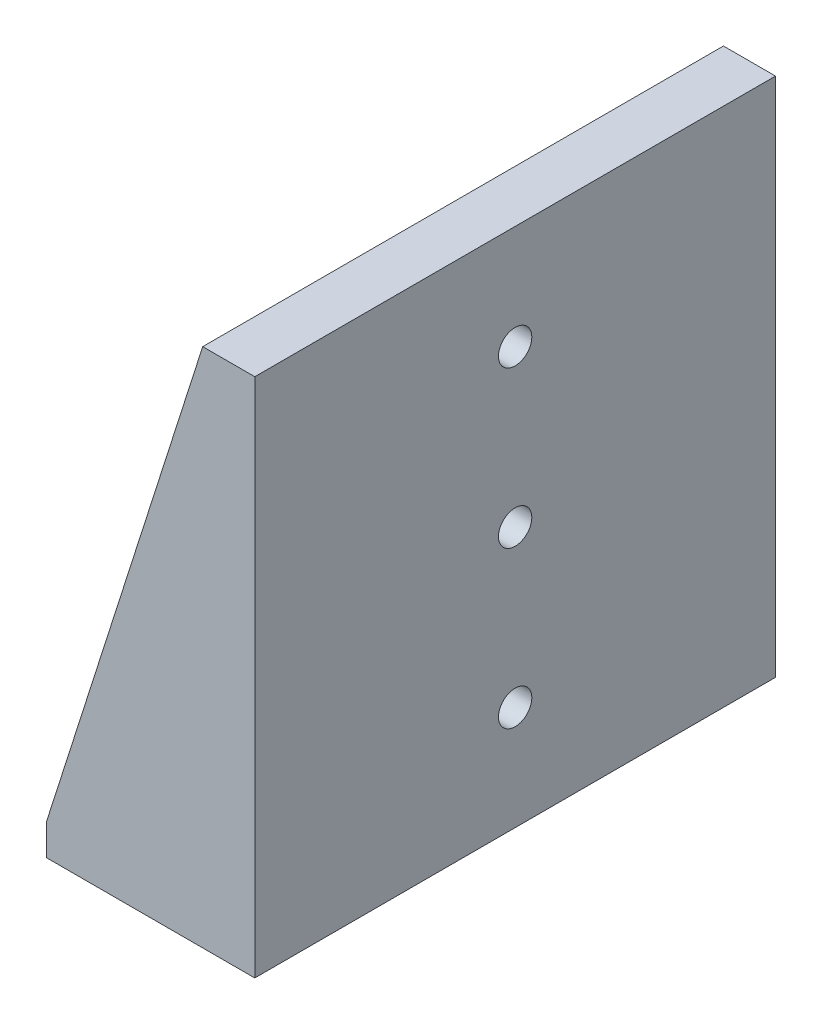
ISO-10303-21;
HEADER;
FILE_DESCRIPTION(('STEP AP214'),'2;1');
FILE_NAME('part.step','',(''),(''),'','','');
FILE_SCHEMA(('AUTOMOTIVE_DESIGN { 1 0 10303 214 1 1 1 1 }'));
ENDSEC;
DATA;
#1=APPLICATION_CONTEXT('core data for automotive mechanical design processes');
#2=APPLICATION_PROTOCOL_DEFINITION('international standard','automotive_design',2000,#1);
#3=PRODUCT_CONTEXT('',#1,'mechanical');
#4=PRODUCT('Part','Part','',(#3));
#5=PRODUCT_RELATED_PRODUCT_CATEGORY('part','',(#4));
#6=PRODUCT_DEFINITION_FORMATION('','',#4);
#7=PRODUCT_DEFINITION_CONTEXT('part definition',#1,'design');
#8=PRODUCT_DEFINITION('design','',#6,#7);
#9=PRODUCT_DEFINITION_SHAPE('','',#8);
#10=(LENGTH_UNIT() NAMED_UNIT(*) SI_UNIT(.MILLI.,.METRE.));
#11=(NAMED_UNIT(*) PLANE_ANGLE_UNIT() SI_UNIT($,.RADIAN.));
#12=(NAMED_UNIT(*) SI_UNIT($,.STERADIAN.) SOLID_ANGLE_UNIT());
#13=UNCERTAINTY_MEASURE_WITH_UNIT(LENGTH_MEASURE(1.E-05),#10,'distance_accuracy_value','');
#14=(GEOMETRIC_REPRESENTATION_CONTEXT(3) GLOBAL_UNCERTAINTY_ASSIGNED_CONTEXT((#13)) GLOBAL_UNIT_ASSIGNED_CONTEXT((#10,
#11,#12)) REPRESENTATION_CONTEXT('',''));
#15=CARTESIAN_POINT('',(0.,0.,0.));
#16=DIRECTION('',(0.,0.,1.));
#17=DIRECTION('',(1.,0.,0.));
#18=AXIS2_PLACEMENT_3D('',#15,#16,#17);
#19=CARTESIAN_POINT('',(-10.,3.,50.));
#20=DIRECTION('',(0.952659211218683,-0.304040173793197,0.));
#21=DIRECTION('',(0.304040173793197,0.952659211218683,0.));
#22=AXIS2_PLACEMENT_3D('',#19,#20,#21);
#23=PLANE('',#22);
#24=DIRECTION('',(0.,0.,-1.));
#25=VECTOR('',#24,1.);
#26=CARTESIAN_POINT('',(5.,50.,50.));
#27=LINE('',#26,#25);
#28=CARTESIAN_POINT('',(5.,50.,50.));
#29=VERTEX_POINT('',#28);
#30=CARTESIAN_POINT('',(5.,50.,47.5));
#31=VERTEX_POINT('',#30);
#32=EDGE_CURVE('E293',#29,#31,#27,.T.);
#33=ORIENTED_EDGE('',*,*,#32,.T.);
#34=DIRECTION('',(-0.304040173793197,-0.952659211218683,0.));
#35=VECTOR('',#34,1.);
#36=CARTESIAN_POINT('',(-10.,3.,47.5));
#37=LINE('',#36,#35);
#38=CARTESIAN_POINT('',(-9.68128901761478,3.99862774480702,47.5));
#39=VERTEX_POINT('',#38);
#40=EDGE_CURVE('E245',#31,#39,#37,.T.);
#41=ORIENTED_EDGE('',*,*,#40,.T.);
#42=CARTESIAN_POINT('',(-9.68128901761478,3.99862774480702,46.5));
#43=DIRECTION('',(0.952659211218683,-0.304040173793197,0.));
#44=DIRECTION('',(0.304040173793197,0.952659211218683,0.));
#45=AXIS2_PLACEMENT_3D('',#42,#43,#44);
#46=ELLIPSE('',#45,1.04969330923779,1.);
#47=CARTESIAN_POINT('',(-10.,3.,46.5523700993091));
#48=VERTEX_POINT('',#47);
#49=EDGE_CURVE('E322',#39,#48,#46,.T.);
#50=ORIENTED_EDGE('',*,*,#49,.T.);
#51=DIRECTION('',(0.,0.,-1.));
#52=VECTOR('',#51,1.);
#53=CARTESIAN_POINT('',(-10.,3.,50.));
#54=LINE('',#53,#52);
#55=CARTESIAN_POINT('',(-10.,3.,50.));
#56=VERTEX_POINT('',#55);
#57=EDGE_CURVE('E64',#56,#48,#54,.T.);
#58=ORIENTED_EDGE('',*,*,#57,.F.);
#59=DIRECTION('',(-0.304040173793197,-0.952659211218683,0.));
#60=VECTOR('',#59,1.);
#61=CARTESIAN_POINT('',(-10.,3.,50.));
#62=LINE('',#61,#60);
#63=EDGE_CURVE('E258',#29,#56,#62,.T.);
#64=ORIENTED_EDGE('',*,*,#63,.F.);
#65=EDGE_LOOP('',(#33,#41,#50,#58,#64));
#66=FACE_BOUND('',#65,.T.);
#67=ADVANCED_FACE('F39',(#66),#23,.F.);
#68=CARTESIAN_POINT('',(10.,0.,50.));
#69=DIRECTION('',(-1.,0.,0.));
#70=DIRECTION('',(0.,0.,1.));
#71=AXIS2_PLACEMENT_3D('',#68,#69,#70);
#72=PLANE('',#71);
#73=CARTESIAN_POINT('',(10.,10.,25.));
#74=DIRECTION('',(1.,0.,0.));
#75=DIRECTION('',(0.,0.,-1.));
#76=AXIS2_PLACEMENT_3D('',#73,#74,#75);
#77=CIRCLE('',#76,1.6);
#78=CARTESIAN_POINT('',(10.,10.,23.4));
#79=VERTEX_POINT('',#78);
#80=EDGE_CURVE('E203',#79,#79,#77,.T.);
#81=ORIENTED_EDGE('',*,*,#80,.F.);
#82=EDGE_LOOP('',(#81));
#83=FACE_BOUND('',#82,.T.);
#84=CARTESIAN_POINT('',(10.,25.,25.));
#85=DIRECTION('',(1.,0.,0.));
#86=DIRECTION('',(0.,0.,-1.));
#87=AXIS2_PLACEMENT_3D('',#84,#85,#86);
#88=CIRCLE('',#87,1.6);
#89=CARTESIAN_POINT('',(10.,25.,23.4));
#90=VERTEX_POINT('',#89);
#91=EDGE_CURVE('E212',#90,#90,#88,.T.);
#92=ORIENTED_EDGE('',*,*,#91,.F.);
#93=EDGE_LOOP('',(#92));
#94=FACE_BOUND('',#93,.T.);
#95=CARTESIAN_POINT('',(10.,40.,25.));
#96=DIRECTION('',(1.,0.,0.));
#97=DIRECTION('',(0.,0.,-1.));
#98=AXIS2_PLACEMENT_3D('',#95,#96,#97);
#99=CIRCLE('',#98,1.6);
#100=CARTESIAN_POINT('',(10.,40.,23.4));
#101=VERTEX_POINT('',#100);
#102=EDGE_CURVE('E220',#101,#101,#99,.T.);
#103=ORIENTED_EDGE('',*,*,#102,.F.);
#104=EDGE_LOOP('',(#103));
#105=FACE_BOUND('',#104,.T.);
#106=DIRECTION('',(0.,1.,0.));
#107=VECTOR('',#106,1.);
#108=CARTESIAN_POINT('',(10.,0.,0.));
#109=LINE('',#108,#107);
#110=CARTESIAN_POINT('',(10.,0.,0.));
#111=VERTEX_POINT('',#110);
#112=CARTESIAN_POINT('',(10.,50.,0.));
#113=VERTEX_POINT('',#112);
#114=EDGE_CURVE('E249',#111,#113,#109,.T.);
#115=ORIENTED_EDGE('',*,*,#114,.T.);
#116=DIRECTION('',(0.,0.,-1.));
#117=VECTOR('',#116,1.);
#118=CARTESIAN_POINT('',(10.,50.,50.));
#119=LINE('',#118,#117);
#120=CARTESIAN_POINT('',(10.,50.,50.));
#121=VERTEX_POINT('',#120);
#122=EDGE_CURVE('E297',#121,#113,#119,.T.);
#123=ORIENTED_EDGE('',*,*,#122,.F.);
#124=DIRECTION('',(0.,1.,0.));
#125=VECTOR('',#124,1.);
#126=CARTESIAN_POINT('',(10.,0.,50.));
#127=LINE('',#126,#125);
#128=CARTESIAN_POINT('',(10.,0.,50.));
#129=VERTEX_POINT('',#128);
#130=EDGE_CURVE('E250',#129,#121,#127,.T.);
#131=ORIENTED_EDGE('',*,*,#130,.F.);
#132=DIRECTION('',(0.,0.,-1.));
#133=VECTOR('',#132,1.);
#134=CARTESIAN_POINT('',(10.,0.,50.));
#135=LINE('',#134,#133);
#136=EDGE_CURVE('E267',#129,#111,#135,.T.);
#137=ORIENTED_EDGE('',*,*,#136,.T.);
#138=EDGE_LOOP('',(#115,#123,#131,#137));
#139=FACE_BOUND('',#138,.T.);
#140=ADVANCED_FACE('F405',(#83,#94,#105,#139),#72,.F.);
#141=CARTESIAN_POINT('',(5.,50.,50.));
#142=DIRECTION('',(0.,-1.,0.));
#143=DIRECTION('',(0.,0.,-1.));
#144=AXIS2_PLACEMENT_3D('',#141,#142,#143);
#145=PLANE('',#144);
#146=DIRECTION('',(-1.,0.,0.));
#147=VECTOR('',#146,1.);
#148=CARTESIAN_POINT('',(5.,50.,0.));
#149=LINE('',#148,#147);
#150=CARTESIAN_POINT('',(5.,50.,0.));
#151=VERTEX_POINT('',#150);
#152=EDGE_CURVE('E271',#113,#151,#149,.T.);
#153=ORIENTED_EDGE('',*,*,#152,.T.);
#154=CARTESIAN_POINT('',(5.,50.,2.5));
#155=VERTEX_POINT('',#154);
#156=EDGE_CURVE('E292',#155,#151,#27,.T.);
#157=ORIENTED_EDGE('',*,*,#156,.F.);
#158=DIRECTION('',(0.,0.,-1.));
#159=VECTOR('',#158,1.);
#160=CARTESIAN_POINT('',(5.,50.,2.5));
#161=LINE('',#160,#159);
#162=EDGE_CURVE('E229',#31,#155,#161,.T.);
#163=ORIENTED_EDGE('',*,*,#162,.F.);
#164=ORIENTED_EDGE('',*,*,#32,.F.);
#165=DIRECTION('',(-1.,0.,0.));
#166=VECTOR('',#165,1.);
#167=CARTESIAN_POINT('',(5.,50.,50.));
#168=LINE('',#167,#166);
#169=EDGE_CURVE('E254',#121,#29,#168,.T.);
#170=ORIENTED_EDGE('',*,*,#169,.F.);
#171=ORIENTED_EDGE('',*,*,#122,.T.);
#172=EDGE_LOOP('',(#153,#157,#163,#164,#170,#171));
#173=FACE_BOUND('',#172,.T.);
#174=ADVANCED_FACE('F357',(#173),#145,.F.);
#175=CARTESIAN_POINT('',(-10.,3.,3.44762990069088));
#176=VERTEX_POINT('',#175);
#177=CARTESIAN_POINT('',(-10.,3.,0.));
#178=VERTEX_POINT('',#177);
#179=EDGE_CURVE('E56',#176,#178,#54,.T.);
#180=ORIENTED_EDGE('',*,*,#179,.F.);
#181=CARTESIAN_POINT('',(-9.68128901761478,3.99862774480702,3.5));
#182=DIRECTION('',(0.952659211218683,-0.304040173793197,0.));
#183=DIRECTION('',(0.304040173793197,0.952659211218683,0.));
#184=AXIS2_PLACEMENT_3D('',#181,#182,#183);
#185=ELLIPSE('',#184,1.04969330923779,1.);
#186=CARTESIAN_POINT('',(-9.68128901761478,3.99862774480702,2.5));
#187=VERTEX_POINT('',#186);
#188=EDGE_CURVE('E11',#176,#187,#185,.T.);
#189=ORIENTED_EDGE('',*,*,#188,.T.);
#190=DIRECTION('',(0.304040173793197,0.952659211218683,0.));
#191=VECTOR('',#190,1.);
#192=CARTESIAN_POINT('',(-10.,3.,2.5));
#193=LINE('',#192,#191);
#194=EDGE_CURVE('E240',#187,#155,#193,.T.);
#195=ORIENTED_EDGE('',*,*,#194,.T.);
#196=ORIENTED_EDGE('',*,*,#156,.T.);
#197=DIRECTION('',(-0.304040173793197,-0.952659211218683,0.));
#198=VECTOR('',#197,1.);
#199=CARTESIAN_POINT('',(-10.,3.,0.));
#200=LINE('',#199,#198);
#201=EDGE_CURVE('E275',#151,#178,#200,.T.);
#202=ORIENTED_EDGE('',*,*,#201,.T.);
#203=EDGE_LOOP('',(#180,#189,#195,#196,#202));
#204=FACE_BOUND('',#203,.T.);
#205=ADVANCED_FACE('F350',(#204),#23,.F.);
#206=CARTESIAN_POINT('',(-10.,0.,50.));
#207=DIRECTION('',(1.,0.,0.));
#208=DIRECTION('',(0.,0.,-1.));
#209=AXIS2_PLACEMENT_3D('',#206,#207,#208);
#210=PLANE('',#209);
#211=ORIENTED_EDGE('',*,*,#57,.T.);
#212=CARTESIAN_POINT('',(-10.,3.99862774480702,46.5));
#213=DIRECTION('',(1.,0.,0.));
#214=DIRECTION('',(0.,0.,-1.));
#215=AXIS2_PLACEMENT_3D('',#212,#213,#214);
#216=CIRCLE('',#215,1.);
#217=CARTESIAN_POINT('',(-10.,2.99862774480702,46.5));
#218=VERTEX_POINT('',#217);
#219=EDGE_CURVE('E325',#48,#218,#216,.T.);
#220=ORIENTED_EDGE('',*,*,#219,.T.);
#221=DIRECTION('',(0.,0.,1.));
#222=VECTOR('',#221,1.);
#223=CARTESIAN_POINT('',(-10.,2.99862774480702,2.5));
#224=LINE('',#223,#222);
#225=CARTESIAN_POINT('',(-10.,2.99862774480702,3.5));
#226=VERTEX_POINT('',#225);
#227=EDGE_CURVE('E228',#226,#218,#224,.T.);
#228=ORIENTED_EDGE('',*,*,#227,.F.);
#229=CARTESIAN_POINT('',(-10.,3.99862774480702,3.5));
#230=DIRECTION('',(1.,0.,0.));
#231=DIRECTION('',(0.,0.,-1.));
#232=AXIS2_PLACEMENT_3D('',#229,#230,#231);
#233=CIRCLE('',#232,1.);
#234=EDGE_CURVE('E49',#226,#176,#233,.T.);
#235=ORIENTED_EDGE('',*,*,#234,.T.);
#236=ORIENTED_EDGE('',*,*,#179,.T.);
#237=DIRECTION('',(0.,-1.,0.));
#238=VECTOR('',#237,1.);
#239=CARTESIAN_POINT('',(-10.,0.,0.));
#240=LINE('',#239,#238);
#241=CARTESIAN_POINT('',(-10.,0.,0.));
#242=VERTEX_POINT('',#241);
#243=EDGE_CURVE('E278',#178,#242,#240,.T.);
#244=ORIENTED_EDGE('',*,*,#243,.T.);
#245=DIRECTION('',(0.,0.,-1.));
#246=VECTOR('',#245,1.);
#247=CARTESIAN_POINT('',(-10.,0.,50.));
#248=LINE('',#247,#246);
#249=CARTESIAN_POINT('',(-10.,0.,50.));
#250=VERTEX_POINT('',#249);
#251=EDGE_CURVE('E286',#250,#242,#248,.T.);
#252=ORIENTED_EDGE('',*,*,#251,.F.);
#253=DIRECTION('',(0.,-1.,0.));
#254=VECTOR('',#253,1.);
#255=CARTESIAN_POINT('',(-10.,0.,50.));
#256=LINE('',#255,#254);
#257=EDGE_CURVE('E261',#56,#250,#256,.T.);
#258=ORIENTED_EDGE('',*,*,#257,.F.);
#259=EDGE_LOOP('',(#211,#220,#228,#235,#236,#244,#252,#258));
#260=FACE_BOUND('',#259,.T.);
#261=ADVANCED_FACE('F364',(#260),#210,.F.);
#262=CARTESIAN_POINT('',(-10.,0.,50.));
#263=DIRECTION('',(0.,1.,0.));
#264=DIRECTION('',(-1.,0.,0.));
#265=AXIS2_PLACEMENT_3D('',#262,#263,#264);
#266=PLANE('',#265);
#267=DIRECTION('',(1.,0.,0.));
#268=VECTOR('',#267,1.);
#269=CARTESIAN_POINT('',(-7.,0.,24.));
#270=LINE('',#269,#268);
#271=CARTESIAN_POINT('',(-7.,0.,24.));
#272=VERTEX_POINT('',#271);
#273=CARTESIAN_POINT('',(3.,0.,24.));
#274=VERTEX_POINT('',#273);
#275=EDGE_CURVE('E343',#272,#274,#270,.T.);
#276=ORIENTED_EDGE('',*,*,#275,.F.);
#277=CARTESIAN_POINT('',(-7.,0.,25.));
#278=DIRECTION('',(0.,1.,0.));
#279=DIRECTION('',(-1.,0.,0.));
#280=AXIS2_PLACEMENT_3D('',#277,#278,#279);
#281=CIRCLE('',#280,1.);
#282=CARTESIAN_POINT('',(-7.,0.,26.));
#283=VERTEX_POINT('',#282);
#284=EDGE_CURVE('E204',#283,#272,#281,.F.);
#285=ORIENTED_EDGE('',*,*,#284,.F.);
#286=DIRECTION('',(-1.,0.,0.));
#287=VECTOR('',#286,1.);
#288=CARTESIAN_POINT('',(-7.,0.,26.));
#289=LINE('',#288,#287);
#290=CARTESIAN_POINT('',(3.,0.,26.));
#291=VERTEX_POINT('',#290);
#292=EDGE_CURVE('E200',#291,#283,#289,.T.);
#293=ORIENTED_EDGE('',*,*,#292,.F.);
#294=CARTESIAN_POINT('',(3.,0.,25.));
#295=DIRECTION('',(0.,1.,0.));
#296=DIRECTION('',(-1.,0.,0.));
#297=AXIS2_PLACEMENT_3D('',#294,#295,#296);
#298=CIRCLE('',#297,1.);
#299=EDGE_CURVE('E160',#274,#291,#298,.F.);
#300=ORIENTED_EDGE('',*,*,#299,.F.);
#301=EDGE_LOOP('',(#276,#285,#293,#300));
#302=FACE_BOUND('',#301,.T.);
#303=DIRECTION('',(1.,0.,0.));
#304=VECTOR('',#303,1.);
#305=CARTESIAN_POINT('',(-10.,0.,0.));
#306=LINE('',#305,#304);
#307=EDGE_CURVE('E255',#242,#111,#306,.T.);
#308=ORIENTED_EDGE('',*,*,#307,.T.);
#309=ORIENTED_EDGE('',*,*,#136,.F.);
#310=DIRECTION('',(1.,0.,0.));
#311=VECTOR('',#310,1.);
#312=CARTESIAN_POINT('',(-10.,0.,50.));
#313=LINE('',#312,#311);
#314=EDGE_CURVE('E264',#250,#129,#313,.T.);
#315=ORIENTED_EDGE('',*,*,#314,.F.);
#316=ORIENTED_EDGE('',*,*,#251,.T.);
#317=EDGE_LOOP('',(#308,#309,#315,#316));
#318=FACE_BOUND('',#317,.T.);
#319=ADVANCED_FACE('F367',(#302,#318),#266,.F.);
#320=CARTESIAN_POINT('',(0.,0.,50.));
#321=DIRECTION('',(0.,0.,-1.));
#322=DIRECTION('',(-1.,0.,0.));
#323=AXIS2_PLACEMENT_3D('',#320,#321,#322);
#324=PLANE('',#323);
#325=ORIENTED_EDGE('',*,*,#130,.T.);
#326=ORIENTED_EDGE('',*,*,#169,.T.);
#327=ORIENTED_EDGE('',*,*,#63,.T.);
#328=ORIENTED_EDGE('',*,*,#257,.T.);
#329=ORIENTED_EDGE('',*,*,#314,.T.);
#330=EDGE_LOOP('',(#325,#326,#327,#328,#329));
#331=FACE_BOUND('',#330,.T.);
#332=ADVANCED_FACE('F371',(#331),#324,.F.);
#333=CARTESIAN_POINT('',(0.,0.,0.));
#334=DIRECTION('',(0.,0.,-1.));
#335=DIRECTION('',(-1.,0.,0.));
#336=AXIS2_PLACEMENT_3D('',#333,#334,#335);
#337=PLANE('',#336);
#338=ORIENTED_EDGE('',*,*,#114,.F.);
#339=ORIENTED_EDGE('',*,*,#307,.F.);
#340=ORIENTED_EDGE('',*,*,#243,.F.);
#341=ORIENTED_EDGE('',*,*,#201,.F.);
#342=ORIENTED_EDGE('',*,*,#152,.F.);
#343=EDGE_LOOP('',(#338,#339,#340,#341,#342));
#344=FACE_BOUND('',#343,.T.);
#345=ADVANCED_FACE('F361',(#344),#337,.T.);
#346=CARTESIAN_POINT('',(5.,2.99862774480702,47.5));
#347=DIRECTION('',(0.,0.,1.));
#348=DIRECTION('',(1.,0.,0.));
#349=AXIS2_PLACEMENT_3D('',#346,#347,#348);
#350=PLANE('',#349);
#351=DIRECTION('',(0.,1.,0.));
#352=VECTOR('',#351,1.);
#353=CARTESIAN_POINT('',(5.,2.99862774480702,47.5));
#354=LINE('',#353,#352);
#355=CARTESIAN_POINT('',(5.,3.99862774480702,47.5));
#356=VERTEX_POINT('',#355);
#357=EDGE_CURVE('E237',#356,#31,#354,.T.);
#358=ORIENTED_EDGE('',*,*,#357,.F.);
#359=DIRECTION('',(-1.,0.,0.));
#360=VECTOR('',#359,1.);
#361=CARTESIAN_POINT('',(-10.,3.99862774480702,47.5));
#362=LINE('',#361,#360);
#363=EDGE_CURVE('E316',#356,#39,#362,.T.);
#364=ORIENTED_EDGE('',*,*,#363,.T.);
#365=ORIENTED_EDGE('',*,*,#40,.F.);
#366=EDGE_LOOP('',(#358,#364,#365));
#367=FACE_BOUND('',#366,.T.);
#368=ADVANCED_FACE('F393',(#367),#350,.F.);
#369=CARTESIAN_POINT('',(5.,50.,2.5));
#370=DIRECTION('',(0.,0.,-1.));
#371=DIRECTION('',(0.,1.,0.));
#372=AXIS2_PLACEMENT_3D('',#369,#370,#371);
#373=PLANE('',#372);
#374=ORIENTED_EDGE('',*,*,#194,.F.);
#375=DIRECTION('',(-1.,0.,0.));
#376=VECTOR('',#375,1.);
#377=CARTESIAN_POINT('',(5.,3.99862774480702,2.5));
#378=LINE('',#377,#376);
#379=CARTESIAN_POINT('',(5.,3.99862774480702,2.5));
#380=VERTEX_POINT('',#379);
#381=EDGE_CURVE('E319',#187,#380,#378,.F.);
#382=ORIENTED_EDGE('',*,*,#381,.T.);
#383=DIRECTION('',(0.,-1.,0.));
#384=VECTOR('',#383,1.);
#385=CARTESIAN_POINT('',(5.,50.,2.5));
#386=LINE('',#385,#384);
#387=EDGE_CURVE('E233',#155,#380,#386,.T.);
#388=ORIENTED_EDGE('',*,*,#387,.F.);
#389=EDGE_LOOP('',(#374,#382,#388));
#390=FACE_BOUND('',#389,.T.);
#391=ADVANCED_FACE('F388',(#390),#373,.F.);
#392=CARTESIAN_POINT('',(5.,2.99862774480702,2.5));
#393=DIRECTION('',(0.,-1.,0.));
#394=DIRECTION('',(0.,0.,-1.));
#395=AXIS2_PLACEMENT_3D('',#392,#393,#394);
#396=PLANE('',#395);
#397=ORIENTED_EDGE('',*,*,#227,.T.);
#398=DIRECTION('',(-1.,0.,0.));
#399=VECTOR('',#398,1.);
#400=CARTESIAN_POINT('',(5.,2.99862774480702,46.5));
#401=LINE('',#400,#399);
#402=CARTESIAN_POINT('',(4.,2.99862774480702,46.5));
#403=VERTEX_POINT('',#402);
#404=EDGE_CURVE('E313',#218,#403,#401,.F.);
#405=ORIENTED_EDGE('',*,*,#404,.T.);
#406=DIRECTION('',(0.,0.,1.));
#407=VECTOR('',#406,1.);
#408=CARTESIAN_POINT('',(4.,2.99862774480702,2.5));
#409=LINE('',#408,#407);
#410=CARTESIAN_POINT('',(4.,2.99862774480702,25.));
#411=VERTEX_POINT('',#410);
#412=EDGE_CURVE('E181',#403,#411,#409,.F.);
#413=ORIENTED_EDGE('',*,*,#412,.T.);
#414=CARTESIAN_POINT('',(3.,2.99862774480702,25.));
#415=DIRECTION('',(0.,1.,0.));
#416=DIRECTION('',(0.,0.,1.));
#417=AXIS2_PLACEMENT_3D('',#414,#415,#416);
#418=CIRCLE('',#417,1.);
#419=CARTESIAN_POINT('',(3.,2.99862774480702,26.));
#420=VERTEX_POINT('',#419);
#421=EDGE_CURVE('E156',#420,#411,#418,.T.);
#422=ORIENTED_EDGE('',*,*,#421,.F.);
#423=DIRECTION('',(1.,0.,0.));
#424=VECTOR('',#423,1.);
#425=CARTESIAN_POINT('',(-7.,2.99862774480702,26.));
#426=LINE('',#425,#424);
#427=CARTESIAN_POINT('',(-7.,2.99862774480702,26.));
#428=VERTEX_POINT('',#427);
#429=EDGE_CURVE('E169',#428,#420,#426,.T.);
#430=ORIENTED_EDGE('',*,*,#429,.F.);
#431=CARTESIAN_POINT('',(-7.,2.99862774480702,25.));
#432=DIRECTION('',(0.,1.,0.));
#433=DIRECTION('',(0.,0.,1.));
#434=AXIS2_PLACEMENT_3D('',#431,#432,#433);
#435=CIRCLE('',#434,1.);
#436=CARTESIAN_POINT('',(-7.,2.99862774480702,24.));
#437=VERTEX_POINT('',#436);
#438=EDGE_CURVE('E176',#437,#428,#435,.T.);
#439=ORIENTED_EDGE('',*,*,#438,.F.);
#440=DIRECTION('',(-1.,0.,0.));
#441=VECTOR('',#440,1.);
#442=CARTESIAN_POINT('',(-7.,2.99862774480702,24.));
#443=LINE('',#442,#441);
#444=CARTESIAN_POINT('',(3.,2.99862774480702,24.));
#445=VERTEX_POINT('',#444);
#446=EDGE_CURVE('E184',#445,#437,#443,.T.);
#447=ORIENTED_EDGE('',*,*,#446,.F.);
#448=EDGE_CURVE('E175',#411,#445,#418,.T.);
#449=ORIENTED_EDGE('',*,*,#448,.F.);
#450=DIRECTION('',(0.,0.,1.));
#451=VECTOR('',#450,1.);
#452=CARTESIAN_POINT('',(4.,2.99862774480702,2.5));
#453=LINE('',#452,#451);
#454=CARTESIAN_POINT('',(4.,2.99862774480702,3.5));
#455=VERTEX_POINT('',#454);
#456=EDGE_CURVE('E308',#411,#455,#453,.F.);
#457=ORIENTED_EDGE('',*,*,#456,.T.);
#458=DIRECTION('',(-1.,0.,0.));
#459=VECTOR('',#458,1.);
#460=CARTESIAN_POINT('',(-10.,2.99862774480702,3.5));
#461=LINE('',#460,#459);
#462=EDGE_CURVE('E305',#455,#226,#461,.T.);
#463=ORIENTED_EDGE('',*,*,#462,.T.);
#464=EDGE_LOOP('',(#397,#405,#413,#422,#430,#439,#447,#449,#457,#463));
#465=FACE_BOUND('',#464,.T.);
#466=ADVANCED_FACE('F179',(#465),#396,.F.);
#467=CARTESIAN_POINT('',(5.,0.,0.));
#468=DIRECTION('',(-1.,0.,0.));
#469=DIRECTION('',(0.,0.,1.));
#470=AXIS2_PLACEMENT_3D('',#467,#468,#469);
#471=PLANE('',#470);
#472=CARTESIAN_POINT('',(5.,10.,25.));
#473=DIRECTION('',(-1.,0.,0.));
#474=DIRECTION('',(0.,0.,1.));
#475=AXIS2_PLACEMENT_3D('',#472,#473,#474);
#476=CIRCLE('',#475,1.6);
#477=CARTESIAN_POINT('',(5.,10.,26.6));
#478=VERTEX_POINT('',#477);
#479=EDGE_CURVE('E208',#478,#478,#476,.F.);
#480=ORIENTED_EDGE('',*,*,#479,.T.);
#481=EDGE_LOOP('',(#480));
#482=FACE_BOUND('',#481,.T.);
#483=CARTESIAN_POINT('',(5.,25.,25.));
#484=DIRECTION('',(-1.,0.,0.));
#485=DIRECTION('',(0.,0.,1.));
#486=AXIS2_PLACEMENT_3D('',#483,#484,#485);
#487=CIRCLE('',#486,1.6);
#488=CARTESIAN_POINT('',(5.,25.,26.6));
#489=VERTEX_POINT('',#488);
#490=EDGE_CURVE('E216',#489,#489,#487,.F.);
#491=ORIENTED_EDGE('',*,*,#490,.T.);
#492=EDGE_LOOP('',(#491));
#493=FACE_BOUND('',#492,.T.);
#494=CARTESIAN_POINT('',(5.,40.,25.));
#495=DIRECTION('',(-1.,0.,0.));
#496=DIRECTION('',(0.,0.,1.));
#497=AXIS2_PLACEMENT_3D('',#494,#495,#496);
#498=CIRCLE('',#497,1.6);
#499=CARTESIAN_POINT('',(5.,40.,26.6));
#500=VERTEX_POINT('',#499);
#501=EDGE_CURVE('E224',#500,#500,#498,.F.);
#502=ORIENTED_EDGE('',*,*,#501,.T.);
#503=EDGE_LOOP('',(#502));
#504=FACE_BOUND('',#503,.T.);
#505=ORIENTED_EDGE('',*,*,#387,.T.);
#506=DIRECTION('',(0.,0.,1.));
#507=VECTOR('',#506,1.);
#508=CARTESIAN_POINT('',(5.,3.99862774480702,0.));
#509=LINE('',#508,#507);
#510=EDGE_CURVE('E301',#380,#356,#509,.T.);
#511=ORIENTED_EDGE('',*,*,#510,.T.);
#512=ORIENTED_EDGE('',*,*,#357,.T.);
#513=ORIENTED_EDGE('',*,*,#162,.T.);
#514=EDGE_LOOP('',(#505,#511,#512,#513));
#515=FACE_BOUND('',#514,.T.);
#516=ADVANCED_FACE('F390',(#482,#493,#504,#515),#471,.T.);
#517=CARTESIAN_POINT('',(0.474516600406094,40.,25.));
#518=DIRECTION('',(1.,0.,0.));
#519=DIRECTION('',(0.,0.,-1.));
#520=AXIS2_PLACEMENT_3D('',#517,#518,#519);
#521=CYLINDRICAL_SURFACE('',#520,1.6);
#522=ORIENTED_EDGE('',*,*,#102,.T.);
#523=EDGE_LOOP('',(#522));
#524=FACE_BOUND('',#523,.T.);
#525=ORIENTED_EDGE('',*,*,#501,.F.);
#526=EDGE_LOOP('',(#525));
#527=FACE_BOUND('',#526,.T.);
#528=ADVANCED_FACE('F449',(#524,#527),#521,.F.);
#529=CARTESIAN_POINT('',(0.474516600406094,25.,25.));
#530=DIRECTION('',(1.,0.,0.));
#531=DIRECTION('',(0.,0.,-1.));
#532=AXIS2_PLACEMENT_3D('',#529,#530,#531);
#533=CYLINDRICAL_SURFACE('',#532,1.6);
#534=ORIENTED_EDGE('',*,*,#91,.T.);
#535=EDGE_LOOP('',(#534));
#536=FACE_BOUND('',#535,.T.);
#537=ORIENTED_EDGE('',*,*,#490,.F.);
#538=EDGE_LOOP('',(#537));
#539=FACE_BOUND('',#538,.T.);
#540=ADVANCED_FACE('F445',(#536,#539),#533,.F.);
#541=CARTESIAN_POINT('',(0.474516600406094,10.,25.));
#542=DIRECTION('',(1.,0.,0.));
#543=DIRECTION('',(0.,0.,-1.));
#544=AXIS2_PLACEMENT_3D('',#541,#542,#543);
#545=CYLINDRICAL_SURFACE('',#544,1.6);
#546=ORIENTED_EDGE('',*,*,#80,.T.);
#547=EDGE_LOOP('',(#546));
#548=FACE_BOUND('',#547,.T.);
#549=ORIENTED_EDGE('',*,*,#479,.F.);
#550=EDGE_LOOP('',(#549));
#551=FACE_BOUND('',#550,.T.);
#552=ADVANCED_FACE('F442',(#548,#551),#545,.F.);
#553=CARTESIAN_POINT('',(-7.,-12.1655250605964,25.));
#554=DIRECTION('',(0.,1.,0.));
#555=DIRECTION('',(0.,0.,1.));
#556=AXIS2_PLACEMENT_3D('',#553,#554,#555);
#557=CYLINDRICAL_SURFACE('',#556,1.);
#558=ORIENTED_EDGE('',*,*,#284,.T.);
#559=DIRECTION('',(0.,1.,0.));
#560=VECTOR('',#559,1.);
#561=CARTESIAN_POINT('',(-7.,-12.1655250605964,24.));
#562=LINE('',#561,#560);
#563=EDGE_CURVE('E192',#272,#437,#562,.T.);
#564=ORIENTED_EDGE('',*,*,#563,.T.);
#565=ORIENTED_EDGE('',*,*,#438,.T.);
#566=DIRECTION('',(0.,1.,0.));
#567=VECTOR('',#566,1.);
#568=CARTESIAN_POINT('',(-7.,-12.1655250605964,26.));
#569=LINE('',#568,#567);
#570=EDGE_CURVE('E165',#283,#428,#569,.T.);
#571=ORIENTED_EDGE('',*,*,#570,.F.);
#572=EDGE_LOOP('',(#558,#564,#565,#571));
#573=FACE_BOUND('',#572,.T.);
#574=ADVANCED_FACE('F439',(#573),#557,.F.);
#575=CARTESIAN_POINT('',(-7.,-12.1655250605964,24.));
#576=DIRECTION('',(0.,0.,-1.));
#577=DIRECTION('',(-1.,0.,0.));
#578=AXIS2_PLACEMENT_3D('',#575,#576,#577);
#579=PLANE('',#578);
#580=ORIENTED_EDGE('',*,*,#275,.T.);
#581=DIRECTION('',(0.,1.,0.));
#582=VECTOR('',#581,1.);
#583=CARTESIAN_POINT('',(3.,-12.1655250605964,24.));
#584=LINE('',#583,#582);
#585=EDGE_CURVE('E164',#274,#445,#584,.T.);
#586=ORIENTED_EDGE('',*,*,#585,.T.);
#587=ORIENTED_EDGE('',*,*,#446,.T.);
#588=ORIENTED_EDGE('',*,*,#563,.F.);
#589=EDGE_LOOP('',(#580,#586,#587,#588));
#590=FACE_BOUND('',#589,.T.);
#591=ADVANCED_FACE('F435',(#590),#579,.F.);
#592=CARTESIAN_POINT('',(3.,-12.1655250605964,25.));
#593=DIRECTION('',(0.,1.,0.));
#594=DIRECTION('',(0.,0.,1.));
#595=AXIS2_PLACEMENT_3D('',#592,#593,#594);
#596=CYLINDRICAL_SURFACE('',#595,1.);
#597=ORIENTED_EDGE('',*,*,#299,.T.);
#598=DIRECTION('',(0.,1.,0.));
#599=VECTOR('',#598,1.);
#600=CARTESIAN_POINT('',(3.,-12.1655250605964,26.));
#601=LINE('',#600,#599);
#602=EDGE_CURVE('E152',#291,#420,#601,.T.);
#603=ORIENTED_EDGE('',*,*,#602,.T.);
#604=ORIENTED_EDGE('',*,*,#421,.T.);
#605=ORIENTED_EDGE('',*,*,#448,.T.);
#606=ORIENTED_EDGE('',*,*,#585,.F.);
#607=EDGE_LOOP('',(#597,#603,#604,#605,#606));
#608=FACE_BOUND('',#607,.T.);
#609=ADVANCED_FACE('F154',(#608),#596,.F.);
#610=CARTESIAN_POINT('',(-7.,-12.1655250605964,26.));
#611=DIRECTION('',(0.,0.,1.));
#612=DIRECTION('',(1.,0.,0.));
#613=AXIS2_PLACEMENT_3D('',#610,#611,#612);
#614=PLANE('',#613);
#615=ORIENTED_EDGE('',*,*,#292,.T.);
#616=ORIENTED_EDGE('',*,*,#570,.T.);
#617=ORIENTED_EDGE('',*,*,#429,.T.);
#618=ORIENTED_EDGE('',*,*,#602,.F.);
#619=EDGE_LOOP('',(#615,#616,#617,#618));
#620=FACE_BOUND('',#619,.T.);
#621=ADVANCED_FACE('F170',(#620),#614,.F.);
#622=CARTESIAN_POINT('',(5.,3.99862774480702,3.5));
#623=DIRECTION('',(1.,0.,0.));
#624=DIRECTION('',(0.,0.,-1.));
#625=AXIS2_PLACEMENT_3D('',#622,#623,#624);
#626=CYLINDRICAL_SURFACE('',#625,1.);
#627=ORIENTED_EDGE('',*,*,#234,.F.);
#628=ORIENTED_EDGE('',*,*,#462,.F.);
#629=CARTESIAN_POINT('',(4.,3.99862774480702,3.5));
#630=DIRECTION('',(0.707106781186547,0.,0.707106781186547));
#631=DIRECTION('',(-0.707106781186547,0.,0.707106781186547));
#632=AXIS2_PLACEMENT_3D('',#629,#630,#631);
#633=ELLIPSE('',#632,1.41421356237309,1.);
#634=EDGE_CURVE('E43',#380,#455,#633,.F.);
#635=ORIENTED_EDGE('',*,*,#634,.F.);
#636=ORIENTED_EDGE('',*,*,#381,.F.);
#637=ORIENTED_EDGE('',*,*,#188,.F.);
#638=EDGE_LOOP('',(#627,#628,#635,#636,#637));
#639=FACE_BOUND('',#638,.T.);
#640=ADVANCED_FACE('F41',(#639),#626,.F.);
#641=CARTESIAN_POINT('',(5.,3.99862774480702,46.5));
#642=DIRECTION('',(1.,0.,0.));
#643=DIRECTION('',(0.,0.,-1.));
#644=AXIS2_PLACEMENT_3D('',#641,#642,#643);
#645=CYLINDRICAL_SURFACE('',#644,1.);
#646=ORIENTED_EDGE('',*,*,#49,.F.);
#647=ORIENTED_EDGE('',*,*,#363,.F.);
#648=CARTESIAN_POINT('',(4.,3.99862774480702,46.5));
#649=DIRECTION('',(-0.707106781186547,0.,0.707106781186547));
#650=DIRECTION('',(0.707106781186547,0.,0.707106781186547));
#651=AXIS2_PLACEMENT_3D('',#648,#649,#650);
#652=ELLIPSE('',#651,1.41421356237309,1.);
#653=EDGE_CURVE('E329',#403,#356,#652,.T.);
#654=ORIENTED_EDGE('',*,*,#653,.F.);
#655=ORIENTED_EDGE('',*,*,#404,.F.);
#656=ORIENTED_EDGE('',*,*,#219,.F.);
#657=EDGE_LOOP('',(#646,#647,#654,#655,#656));
#658=FACE_BOUND('',#657,.T.);
#659=ADVANCED_FACE('F380',(#658),#645,.F.);
#660=CARTESIAN_POINT('',(4.,3.99862774480702,0.));
#661=DIRECTION('',(0.,0.,1.));
#662=DIRECTION('',(0.,-1.,0.));
#663=AXIS2_PLACEMENT_3D('',#660,#661,#662);
#664=CYLINDRICAL_SURFACE('',#663,1.);
#665=ORIENTED_EDGE('',*,*,#456,.F.);
#666=ORIENTED_EDGE('',*,*,#412,.F.);
#667=ORIENTED_EDGE('',*,*,#653,.T.);
#668=ORIENTED_EDGE('',*,*,#510,.F.);
#669=ORIENTED_EDGE('',*,*,#634,.T.);
#670=EDGE_LOOP('',(#665,#666,#667,#668,#669));
#671=FACE_BOUND('',#670,.T.);
#672=ADVANCED_FACE('F422',(#671),#664,.F.);
#673=CLOSED_SHELL('',(#67,#140,#174,#205,#261,#319,#332,#345,#368,#391,#466,#516,#528,#540,#552,
#574,#591,#609,#621,#640,#659,#672));
#674=MANIFOLD_SOLID_BREP('B2',#673);
#675=ADVANCED_BREP_SHAPE_REPRESENTATION('',(#18,#674),#14);
#676=SHAPE_DEFINITION_REPRESENTATION(#9,#675);
ENDSEC;
END-ISO-10303-21;
